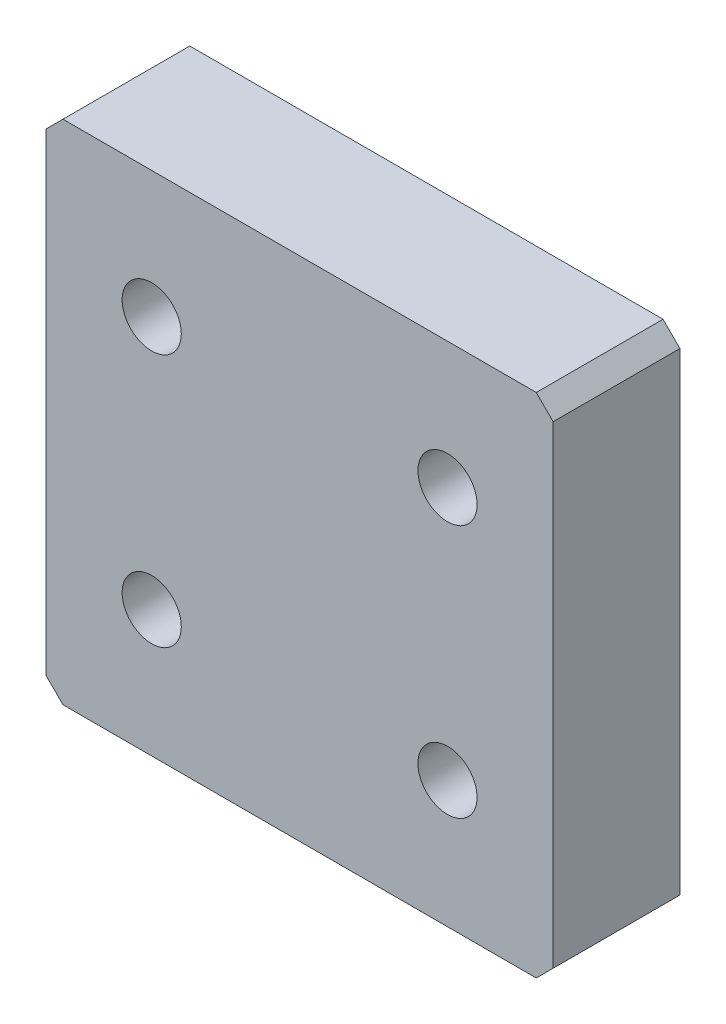
ISO-10303-21;
HEADER;
FILE_DESCRIPTION(('STEP AP214'),'2;1');
FILE_NAME('part.step','',(''),(''),'','','');
FILE_SCHEMA(('AUTOMOTIVE_DESIGN { 1 0 10303 214 1 1 1 1 }'));
ENDSEC;
DATA;
#1=APPLICATION_CONTEXT('core data for automotive mechanical design processes');
#2=APPLICATION_PROTOCOL_DEFINITION('international standard','automotive_design',2000,#1);
#3=PRODUCT_CONTEXT('',#1,'mechanical');
#4=PRODUCT('Part','Part','',(#3));
#5=PRODUCT_RELATED_PRODUCT_CATEGORY('part','',(#4));
#6=PRODUCT_DEFINITION_FORMATION('','',#4);
#7=PRODUCT_DEFINITION_CONTEXT('part definition',#1,'design');
#8=PRODUCT_DEFINITION('design','',#6,#7);
#9=PRODUCT_DEFINITION_SHAPE('','',#8);
#10=(LENGTH_UNIT() NAMED_UNIT(*) SI_UNIT(.MILLI.,.METRE.));
#11=(NAMED_UNIT(*) PLANE_ANGLE_UNIT() SI_UNIT($,.RADIAN.));
#12=(NAMED_UNIT(*) SI_UNIT($,.STERADIAN.) SOLID_ANGLE_UNIT());
#13=UNCERTAINTY_MEASURE_WITH_UNIT(LENGTH_MEASURE(1.E-05),#10,'distance_accuracy_value','');
#14=(GEOMETRIC_REPRESENTATION_CONTEXT(3) GLOBAL_UNCERTAINTY_ASSIGNED_CONTEXT((#13)) GLOBAL_UNIT_ASSIGNED_CONTEXT((#10,
#11,#12)) REPRESENTATION_CONTEXT('',''));
#15=CARTESIAN_POINT('',(0.,0.,0.));
#16=DIRECTION('',(0.,0.,1.));
#17=DIRECTION('',(1.,0.,0.));
#18=AXIS2_PLACEMENT_3D('',#15,#16,#17);
#19=CARTESIAN_POINT('',(0.,0.,15.));
#20=DIRECTION('',(0.,0.,1.));
#21=DIRECTION('',(1.,0.,0.));
#22=AXIS2_PLACEMENT_3D('',#19,#20,#21);
#23=PLANE('',#22);
#24=CARTESIAN_POINT('',(-17.5,-15.,15.));
#25=DIRECTION('',(0.,0.,1.));
#26=DIRECTION('',(1.,0.,0.));
#27=AXIS2_PLACEMENT_3D('',#24,#25,#26);
#28=CIRCLE('',#27,3.5);
#29=CARTESIAN_POINT('',(-14.,-15.,15.));
#30=VERTEX_POINT('',#29);
#31=EDGE_CURVE('E186',#30,#30,#28,.T.);
#32=ORIENTED_EDGE('',*,*,#31,.F.);
#33=EDGE_LOOP('',(#32));
#34=FACE_BOUND('',#33,.T.);
#35=CARTESIAN_POINT('',(-17.5,15.,15.));
#36=DIRECTION('',(0.,0.,1.));
#37=DIRECTION('',(1.,0.,0.));
#38=AXIS2_PLACEMENT_3D('',#35,#36,#37);
#39=CIRCLE('',#38,3.5);
#40=CARTESIAN_POINT('',(-14.,15.,15.));
#41=VERTEX_POINT('',#40);
#42=EDGE_CURVE('E132',#41,#41,#39,.T.);
#43=ORIENTED_EDGE('',*,*,#42,.F.);
#44=EDGE_LOOP('',(#43));
#45=FACE_BOUND('',#44,.T.);
#46=DIRECTION('',(0.,1.,0.));
#47=VECTOR('',#46,1.);
#48=CARTESIAN_POINT('',(30.,30.,15.));
#49=LINE('',#48,#47);
#50=CARTESIAN_POINT('',(30.,-28.,15.));
#51=VERTEX_POINT('',#50);
#52=CARTESIAN_POINT('',(30.,28.,15.));
#53=VERTEX_POINT('',#52);
#54=EDGE_CURVE('E137',#51,#53,#49,.T.);
#55=ORIENTED_EDGE('',*,*,#54,.T.);
#56=DIRECTION('',(0.707106781186545,-0.70710678118655,0.));
#57=VECTOR('',#56,1.);
#58=CARTESIAN_POINT('',(29.0000000000001,28.9999999999999,15.));
#59=LINE('',#58,#57);
#60=CARTESIAN_POINT('',(28.,30.,15.));
#61=VERTEX_POINT('',#60);
#62=EDGE_CURVE('E152',#53,#61,#59,.F.);
#63=ORIENTED_EDGE('',*,*,#62,.T.);
#64=DIRECTION('',(-1.,0.,0.));
#65=VECTOR('',#64,1.);
#66=CARTESIAN_POINT('',(-30.,30.,15.));
#67=LINE('',#66,#65);
#68=CARTESIAN_POINT('',(-28.,30.,15.));
#69=VERTEX_POINT('',#68);
#70=EDGE_CURVE('E119',#61,#69,#67,.T.);
#71=ORIENTED_EDGE('',*,*,#70,.T.);
#72=DIRECTION('',(0.707106781186549,0.707106781186546,0.));
#73=VECTOR('',#72,1.);
#74=CARTESIAN_POINT('',(-28.9999999999999,29.,15.));
#75=LINE('',#74,#73);
#76=CARTESIAN_POINT('',(-30.,28.,15.));
#77=VERTEX_POINT('',#76);
#78=EDGE_CURVE('E150',#69,#77,#75,.F.);
#79=ORIENTED_EDGE('',*,*,#78,.T.);
#80=DIRECTION('',(0.,-1.,0.));
#81=VECTOR('',#80,1.);
#82=CARTESIAN_POINT('',(-30.,30.,15.));
#83=LINE('',#82,#81);
#84=CARTESIAN_POINT('',(-30.,-28.,15.));
#85=VERTEX_POINT('',#84);
#86=EDGE_CURVE('E163',#77,#85,#83,.T.);
#87=ORIENTED_EDGE('',*,*,#86,.T.);
#88=DIRECTION('',(-0.707106781186548,0.707106781186547,0.));
#89=VECTOR('',#88,1.);
#90=CARTESIAN_POINT('',(-29.,-29.,15.));
#91=LINE('',#90,#89);
#92=CARTESIAN_POINT('',(-28.,-30.,15.));
#93=VERTEX_POINT('',#92);
#94=EDGE_CURVE('E54',#85,#93,#91,.F.);
#95=ORIENTED_EDGE('',*,*,#94,.T.);
#96=DIRECTION('',(1.,0.,0.));
#97=VECTOR('',#96,1.);
#98=CARTESIAN_POINT('',(-30.,-30.,15.));
#99=LINE('',#98,#97);
#100=CARTESIAN_POINT('',(28.,-30.,15.));
#101=VERTEX_POINT('',#100);
#102=EDGE_CURVE('E138',#93,#101,#99,.T.);
#103=ORIENTED_EDGE('',*,*,#102,.T.);
#104=DIRECTION('',(-0.707106781186551,-0.707106781186544,0.));
#105=VECTOR('',#104,1.);
#106=CARTESIAN_POINT('',(28.9999999999999,-29.0000000000001,15.));
#107=LINE('',#106,#105);
#108=EDGE_CURVE('E147',#101,#51,#107,.F.);
#109=ORIENTED_EDGE('',*,*,#108,.T.);
#110=EDGE_LOOP('',(#55,#63,#71,#79,#87,#95,#103,#109));
#111=FACE_BOUND('',#110,.T.);
#112=CARTESIAN_POINT('',(17.5,15.,15.));
#113=DIRECTION('',(0.,0.,1.));
#114=DIRECTION('',(1.,0.,0.));
#115=AXIS2_PLACEMENT_3D('',#112,#113,#114);
#116=CIRCLE('',#115,3.5);
#117=CARTESIAN_POINT('',(21.,15.,15.));
#118=VERTEX_POINT('',#117);
#119=EDGE_CURVE('E180',#118,#118,#116,.T.);
#120=ORIENTED_EDGE('',*,*,#119,.F.);
#121=EDGE_LOOP('',(#120));
#122=FACE_BOUND('',#121,.T.);
#123=CARTESIAN_POINT('',(17.5,-15.,15.));
#124=DIRECTION('',(0.,0.,1.));
#125=DIRECTION('',(1.,0.,0.));
#126=AXIS2_PLACEMENT_3D('',#123,#124,#125);
#127=CIRCLE('',#126,3.5);
#128=CARTESIAN_POINT('',(21.,-15.,15.));
#129=VERTEX_POINT('',#128);
#130=EDGE_CURVE('E192',#129,#129,#127,.T.);
#131=ORIENTED_EDGE('',*,*,#130,.F.);
#132=EDGE_LOOP('',(#131));
#133=FACE_BOUND('',#132,.T.);
#134=ADVANCED_FACE('F33',(#34,#45,#111,#122,#133),#23,.T.);
#135=CARTESIAN_POINT('',(0.,0.,0.));
#136=DIRECTION('',(0.,0.,1.));
#137=DIRECTION('',(1.,0.,0.));
#138=AXIS2_PLACEMENT_3D('',#135,#136,#137);
#139=PLANE('',#138);
#140=DIRECTION('',(-1.,0.,0.));
#141=VECTOR('',#140,1.);
#142=CARTESIAN_POINT('',(-30.,30.,0.));
#143=LINE('',#142,#141);
#144=CARTESIAN_POINT('',(28.,30.,0.));
#145=VERTEX_POINT('',#144);
#146=CARTESIAN_POINT('',(-28.,30.,0.));
#147=VERTEX_POINT('',#146);
#148=EDGE_CURVE('E116',#145,#147,#143,.T.);
#149=ORIENTED_EDGE('',*,*,#148,.F.);
#150=DIRECTION('',(-0.707106781186545,0.70710678118655,0.));
#151=VECTOR('',#150,1.);
#152=CARTESIAN_POINT('',(28.,30.,0.));
#153=LINE('',#152,#151);
#154=CARTESIAN_POINT('',(30.,28.,0.));
#155=VERTEX_POINT('',#154);
#156=EDGE_CURVE('E99',#145,#155,#153,.F.);
#157=ORIENTED_EDGE('',*,*,#156,.T.);
#158=DIRECTION('',(0.,1.,0.));
#159=VECTOR('',#158,1.);
#160=CARTESIAN_POINT('',(30.,30.,0.));
#161=LINE('',#160,#159);
#162=CARTESIAN_POINT('',(30.,-28.,0.));
#163=VERTEX_POINT('',#162);
#164=EDGE_CURVE('E127',#163,#155,#161,.T.);
#165=ORIENTED_EDGE('',*,*,#164,.F.);
#166=DIRECTION('',(0.707106781186551,0.707106781186544,0.));
#167=VECTOR('',#166,1.);
#168=CARTESIAN_POINT('',(30.,-28.,0.));
#169=LINE('',#168,#167);
#170=CARTESIAN_POINT('',(28.,-30.,0.));
#171=VERTEX_POINT('',#170);
#172=EDGE_CURVE('E120',#163,#171,#169,.F.);
#173=ORIENTED_EDGE('',*,*,#172,.T.);
#174=DIRECTION('',(1.,0.,0.));
#175=VECTOR('',#174,1.);
#176=CARTESIAN_POINT('',(-30.,-30.,0.));
#177=LINE('',#176,#175);
#178=CARTESIAN_POINT('',(-28.,-30.,0.));
#179=VERTEX_POINT('',#178);
#180=EDGE_CURVE('E130',#179,#171,#177,.T.);
#181=ORIENTED_EDGE('',*,*,#180,.F.);
#182=DIRECTION('',(0.707106781186548,-0.707106781186547,0.));
#183=VECTOR('',#182,1.);
#184=CARTESIAN_POINT('',(-28.,-30.,0.));
#185=LINE('',#184,#183);
#186=CARTESIAN_POINT('',(-30.,-28.,0.));
#187=VERTEX_POINT('',#186);
#188=EDGE_CURVE('E141',#179,#187,#185,.F.);
#189=ORIENTED_EDGE('',*,*,#188,.T.);
#190=DIRECTION('',(0.,-1.,0.));
#191=VECTOR('',#190,1.);
#192=CARTESIAN_POINT('',(-30.,30.,0.));
#193=LINE('',#192,#191);
#194=CARTESIAN_POINT('',(-30.,28.,0.));
#195=VERTEX_POINT('',#194);
#196=EDGE_CURVE('E126',#195,#187,#193,.T.);
#197=ORIENTED_EDGE('',*,*,#196,.F.);
#198=DIRECTION('',(-0.707106781186549,-0.707106781186546,0.));
#199=VECTOR('',#198,1.);
#200=CARTESIAN_POINT('',(-30.,28.,0.));
#201=LINE('',#200,#199);
#202=EDGE_CURVE('E110',#195,#147,#201,.F.);
#203=ORIENTED_EDGE('',*,*,#202,.T.);
#204=EDGE_LOOP('',(#149,#157,#165,#173,#181,#189,#197,#203));
#205=FACE_BOUND('',#204,.T.);
#206=CARTESIAN_POINT('',(-17.5,15.,0.));
#207=DIRECTION('',(0.,0.,1.));
#208=DIRECTION('',(1.,0.,0.));
#209=AXIS2_PLACEMENT_3D('',#206,#207,#208);
#210=CIRCLE('',#209,3.5);
#211=CARTESIAN_POINT('',(-14.,15.,0.));
#212=VERTEX_POINT('',#211);
#213=EDGE_CURVE('E177',#212,#212,#210,.T.);
#214=ORIENTED_EDGE('',*,*,#213,.T.);
#215=EDGE_LOOP('',(#214));
#216=FACE_BOUND('',#215,.T.);
#217=CARTESIAN_POINT('',(17.5,15.,0.));
#218=DIRECTION('',(0.,0.,1.));
#219=DIRECTION('',(1.,0.,0.));
#220=AXIS2_PLACEMENT_3D('',#217,#218,#219);
#221=CIRCLE('',#220,3.5);
#222=CARTESIAN_POINT('',(21.,15.,0.));
#223=VERTEX_POINT('',#222);
#224=EDGE_CURVE('E183',#223,#223,#221,.T.);
#225=ORIENTED_EDGE('',*,*,#224,.T.);
#226=EDGE_LOOP('',(#225));
#227=FACE_BOUND('',#226,.T.);
#228=CARTESIAN_POINT('',(-17.5,-15.,0.));
#229=DIRECTION('',(0.,0.,1.));
#230=DIRECTION('',(1.,0.,0.));
#231=AXIS2_PLACEMENT_3D('',#228,#229,#230);
#232=CIRCLE('',#231,3.5);
#233=CARTESIAN_POINT('',(-14.,-15.,0.));
#234=VERTEX_POINT('',#233);
#235=EDGE_CURVE('E189',#234,#234,#232,.T.);
#236=ORIENTED_EDGE('',*,*,#235,.T.);
#237=EDGE_LOOP('',(#236));
#238=FACE_BOUND('',#237,.T.);
#239=CARTESIAN_POINT('',(17.5,-15.,0.));
#240=DIRECTION('',(0.,0.,1.));
#241=DIRECTION('',(1.,0.,0.));
#242=AXIS2_PLACEMENT_3D('',#239,#240,#241);
#243=CIRCLE('',#242,3.5);
#244=CARTESIAN_POINT('',(21.,-15.,0.));
#245=VERTEX_POINT('',#244);
#246=EDGE_CURVE('E195',#245,#245,#243,.T.);
#247=ORIENTED_EDGE('',*,*,#246,.T.);
#248=EDGE_LOOP('',(#247));
#249=FACE_BOUND('',#248,.T.);
#250=ADVANCED_FACE('F123',(#205,#216,#227,#238,#249),#139,.F.);
#251=CARTESIAN_POINT('',(30.,30.,15.));
#252=DIRECTION('',(-1.,0.,0.));
#253=DIRECTION('',(0.,-1.,0.));
#254=AXIS2_PLACEMENT_3D('',#251,#252,#253);
#255=PLANE('',#254);
#256=ORIENTED_EDGE('',*,*,#164,.T.);
#257=DIRECTION('',(0.,0.,1.));
#258=VECTOR('',#257,1.);
#259=CARTESIAN_POINT('',(30.,28.,15.));
#260=LINE('',#259,#258);
#261=EDGE_CURVE('E104',#155,#53,#260,.T.);
#262=ORIENTED_EDGE('',*,*,#261,.T.);
#263=ORIENTED_EDGE('',*,*,#54,.F.);
#264=DIRECTION('',(0.,0.,-1.));
#265=VECTOR('',#264,1.);
#266=CARTESIAN_POINT('',(30.,-28.,15.));
#267=LINE('',#266,#265);
#268=EDGE_CURVE('E109',#51,#163,#267,.T.);
#269=ORIENTED_EDGE('',*,*,#268,.T.);
#270=EDGE_LOOP('',(#256,#262,#263,#269));
#271=FACE_BOUND('',#270,.T.);
#272=ADVANCED_FACE('F210',(#271),#255,.F.);
#273=CARTESIAN_POINT('',(-30.,30.,15.));
#274=DIRECTION('',(0.,-1.,0.));
#275=DIRECTION('',(0.,0.,-1.));
#276=AXIS2_PLACEMENT_3D('',#273,#274,#275);
#277=PLANE('',#276);
#278=ORIENTED_EDGE('',*,*,#70,.F.);
#279=DIRECTION('',(0.,0.,-1.));
#280=VECTOR('',#279,1.);
#281=CARTESIAN_POINT('',(28.,30.,15.));
#282=LINE('',#281,#280);
#283=EDGE_CURVE('E103',#61,#145,#282,.T.);
#284=ORIENTED_EDGE('',*,*,#283,.T.);
#285=ORIENTED_EDGE('',*,*,#148,.T.);
#286=DIRECTION('',(0.,0.,1.));
#287=VECTOR('',#286,1.);
#288=CARTESIAN_POINT('',(-28.,30.,15.));
#289=LINE('',#288,#287);
#290=EDGE_CURVE('E121',#147,#69,#289,.T.);
#291=ORIENTED_EDGE('',*,*,#290,.T.);
#292=EDGE_LOOP('',(#278,#284,#285,#291));
#293=FACE_BOUND('',#292,.T.);
#294=ADVANCED_FACE('F115',(#293),#277,.F.);
#295=CARTESIAN_POINT('',(-30.,30.,15.));
#296=DIRECTION('',(1.,0.,0.));
#297=DIRECTION('',(0.,1.,0.));
#298=AXIS2_PLACEMENT_3D('',#295,#296,#297);
#299=PLANE('',#298);
#300=ORIENTED_EDGE('',*,*,#86,.F.);
#301=DIRECTION('',(0.,0.,-1.));
#302=VECTOR('',#301,1.);
#303=CARTESIAN_POINT('',(-30.,28.,15.));
#304=LINE('',#303,#302);
#305=EDGE_CURVE('E156',#77,#195,#304,.T.);
#306=ORIENTED_EDGE('',*,*,#305,.T.);
#307=ORIENTED_EDGE('',*,*,#196,.T.);
#308=DIRECTION('',(0.,0.,1.));
#309=VECTOR('',#308,1.);
#310=CARTESIAN_POINT('',(-30.,-28.,15.));
#311=LINE('',#310,#309);
#312=EDGE_CURVE('E154',#187,#85,#311,.T.);
#313=ORIENTED_EDGE('',*,*,#312,.T.);
#314=EDGE_LOOP('',(#300,#306,#307,#313));
#315=FACE_BOUND('',#314,.T.);
#316=ADVANCED_FACE('F161',(#315),#299,.F.);
#317=CARTESIAN_POINT('',(-30.,-30.,15.));
#318=DIRECTION('',(0.,1.,0.));
#319=DIRECTION('',(0.,0.,1.));
#320=AXIS2_PLACEMENT_3D('',#317,#318,#319);
#321=PLANE('',#320);
#322=ORIENTED_EDGE('',*,*,#102,.F.);
#323=DIRECTION('',(0.,0.,-1.));
#324=VECTOR('',#323,1.);
#325=CARTESIAN_POINT('',(-28.,-30.,15.));
#326=LINE('',#325,#324);
#327=EDGE_CURVE('E11',#93,#179,#326,.T.);
#328=ORIENTED_EDGE('',*,*,#327,.T.);
#329=ORIENTED_EDGE('',*,*,#180,.T.);
#330=DIRECTION('',(0.,0.,1.));
#331=VECTOR('',#330,1.);
#332=CARTESIAN_POINT('',(28.,-30.,15.));
#333=LINE('',#332,#331);
#334=EDGE_CURVE('E41',#171,#101,#333,.T.);
#335=ORIENTED_EDGE('',*,*,#334,.T.);
#336=EDGE_LOOP('',(#322,#328,#329,#335));
#337=FACE_BOUND('',#336,.T.);
#338=ADVANCED_FACE('F170',(#337),#321,.F.);
#339=CARTESIAN_POINT('',(-17.5,15.,15.));
#340=DIRECTION('',(0.,0.,-1.));
#341=DIRECTION('',(-1.,0.,0.));
#342=AXIS2_PLACEMENT_3D('',#339,#340,#341);
#343=CYLINDRICAL_SURFACE('',#342,3.5);
#344=ORIENTED_EDGE('',*,*,#42,.T.);
#345=EDGE_LOOP('',(#344));
#346=FACE_BOUND('',#345,.T.);
#347=ORIENTED_EDGE('',*,*,#213,.F.);
#348=EDGE_LOOP('',(#347));
#349=FACE_BOUND('',#348,.T.);
#350=ADVANCED_FACE('F215',(#346,#349),#343,.F.);
#351=CARTESIAN_POINT('',(17.5,15.,15.));
#352=DIRECTION('',(0.,0.,-1.));
#353=DIRECTION('',(-1.,0.,0.));
#354=AXIS2_PLACEMENT_3D('',#351,#352,#353);
#355=CYLINDRICAL_SURFACE('',#354,3.5);
#356=ORIENTED_EDGE('',*,*,#119,.T.);
#357=EDGE_LOOP('',(#356));
#358=FACE_BOUND('',#357,.T.);
#359=ORIENTED_EDGE('',*,*,#224,.F.);
#360=EDGE_LOOP('',(#359));
#361=FACE_BOUND('',#360,.T.);
#362=ADVANCED_FACE('F243',(#358,#361),#355,.F.);
#363=CARTESIAN_POINT('',(-17.5,-15.,15.));
#364=DIRECTION('',(0.,0.,-1.));
#365=DIRECTION('',(-1.,0.,0.));
#366=AXIS2_PLACEMENT_3D('',#363,#364,#365);
#367=CYLINDRICAL_SURFACE('',#366,3.5);
#368=ORIENTED_EDGE('',*,*,#31,.T.);
#369=EDGE_LOOP('',(#368));
#370=FACE_BOUND('',#369,.T.);
#371=ORIENTED_EDGE('',*,*,#235,.F.);
#372=EDGE_LOOP('',(#371));
#373=FACE_BOUND('',#372,.T.);
#374=ADVANCED_FACE('F246',(#370,#373),#367,.F.);
#375=CARTESIAN_POINT('',(17.5,-15.,15.));
#376=DIRECTION('',(0.,0.,-1.));
#377=DIRECTION('',(-1.,0.,0.));
#378=AXIS2_PLACEMENT_3D('',#375,#376,#377);
#379=CYLINDRICAL_SURFACE('',#378,3.5);
#380=ORIENTED_EDGE('',*,*,#130,.T.);
#381=EDGE_LOOP('',(#380));
#382=FACE_BOUND('',#381,.T.);
#383=ORIENTED_EDGE('',*,*,#246,.F.);
#384=EDGE_LOOP('',(#383));
#385=FACE_BOUND('',#384,.T.);
#386=ADVANCED_FACE('F201',(#382,#385),#379,.F.);
#387=CARTESIAN_POINT('',(28.,30.,15.));
#388=DIRECTION('',(-0.70710678118655,-0.707106781186545,0.));
#389=DIRECTION('',(0.,0.,-1.));
#390=AXIS2_PLACEMENT_3D('',#387,#388,#389);
#391=PLANE('',#390);
#392=ORIENTED_EDGE('',*,*,#62,.F.);
#393=ORIENTED_EDGE('',*,*,#261,.F.);
#394=ORIENTED_EDGE('',*,*,#156,.F.);
#395=ORIENTED_EDGE('',*,*,#283,.F.);
#396=EDGE_LOOP('',(#392,#393,#394,#395));
#397=FACE_BOUND('',#396,.T.);
#398=ADVANCED_FACE('F102',(#397),#391,.F.);
#399=CARTESIAN_POINT('',(-30.,28.,15.));
#400=DIRECTION('',(0.707106781186546,-0.707106781186549,0.));
#401=DIRECTION('',(0.,0.,-1.));
#402=AXIS2_PLACEMENT_3D('',#399,#400,#401);
#403=PLANE('',#402);
#404=ORIENTED_EDGE('',*,*,#78,.F.);
#405=ORIENTED_EDGE('',*,*,#290,.F.);
#406=ORIENTED_EDGE('',*,*,#202,.F.);
#407=ORIENTED_EDGE('',*,*,#305,.F.);
#408=EDGE_LOOP('',(#404,#405,#406,#407));
#409=FACE_BOUND('',#408,.T.);
#410=ADVANCED_FACE('F229',(#409),#403,.F.);
#411=CARTESIAN_POINT('',(-28.,-30.,15.));
#412=DIRECTION('',(0.707106781186547,0.707106781186548,0.));
#413=DIRECTION('',(0.,0.,-1.));
#414=AXIS2_PLACEMENT_3D('',#411,#412,#413);
#415=PLANE('',#414);
#416=ORIENTED_EDGE('',*,*,#94,.F.);
#417=ORIENTED_EDGE('',*,*,#312,.F.);
#418=ORIENTED_EDGE('',*,*,#188,.F.);
#419=ORIENTED_EDGE('',*,*,#327,.F.);
#420=EDGE_LOOP('',(#416,#417,#418,#419));
#421=FACE_BOUND('',#420,.T.);
#422=ADVANCED_FACE('F169',(#421),#415,.F.);
#423=CARTESIAN_POINT('',(30.,-28.,15.));
#424=DIRECTION('',(-0.707106781186544,0.707106781186551,0.));
#425=DIRECTION('',(0.,0.,-1.));
#426=AXIS2_PLACEMENT_3D('',#423,#424,#425);
#427=PLANE('',#426);
#428=ORIENTED_EDGE('',*,*,#108,.F.);
#429=ORIENTED_EDGE('',*,*,#334,.F.);
#430=ORIENTED_EDGE('',*,*,#172,.F.);
#431=ORIENTED_EDGE('',*,*,#268,.F.);
#432=EDGE_LOOP('',(#428,#429,#430,#431));
#433=FACE_BOUND('',#432,.T.);
#434=ADVANCED_FACE('F35',(#433),#427,.F.);
#435=CLOSED_SHELL('',(#134,#250,#272,#294,#316,#338,#350,#362,#374,#386,#398,#410,#422,#434));
#436=MANIFOLD_SOLID_BREP('B2',#435);
#437=ADVANCED_BREP_SHAPE_REPRESENTATION('',(#18,#436),#14);
#438=SHAPE_DEFINITION_REPRESENTATION(#9,#437);
ENDSEC;
END-ISO-10303-21;
